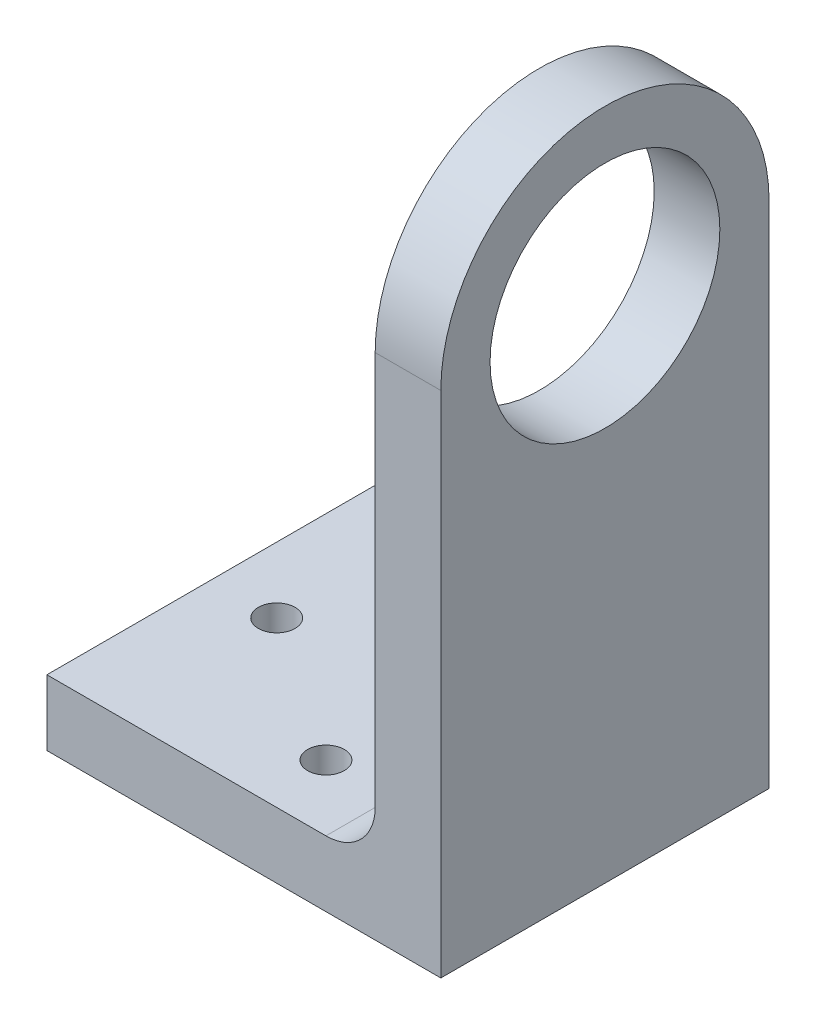
ISO-10303-21;
HEADER;
FILE_DESCRIPTION(('STEP AP214'),'2;1');
FILE_NAME('part.step','',(''),(''),'','','');
FILE_SCHEMA(('AUTOMOTIVE_DESIGN { 1 0 10303 214 1 1 1 1 }'));
ENDSEC;
DATA;
#1=APPLICATION_CONTEXT('core data for automotive mechanical design processes');
#2=APPLICATION_PROTOCOL_DEFINITION('international standard','automotive_design',2000,#1);
#3=PRODUCT_CONTEXT('',#1,'mechanical');
#4=PRODUCT('Part','Part','',(#3));
#5=PRODUCT_RELATED_PRODUCT_CATEGORY('part','',(#4));
#6=PRODUCT_DEFINITION_FORMATION('','',#4);
#7=PRODUCT_DEFINITION_CONTEXT('part definition',#1,'design');
#8=PRODUCT_DEFINITION('design','',#6,#7);
#9=PRODUCT_DEFINITION_SHAPE('','',#8);
#10=(LENGTH_UNIT() NAMED_UNIT(*) SI_UNIT(.MILLI.,.METRE.));
#11=(NAMED_UNIT(*) PLANE_ANGLE_UNIT() SI_UNIT($,.RADIAN.));
#12=(NAMED_UNIT(*) SI_UNIT($,.STERADIAN.) SOLID_ANGLE_UNIT());
#13=UNCERTAINTY_MEASURE_WITH_UNIT(LENGTH_MEASURE(1.E-05),#10,'distance_accuracy_value','');
#14=(GEOMETRIC_REPRESENTATION_CONTEXT(3) GLOBAL_UNCERTAINTY_ASSIGNED_CONTEXT((#13)) GLOBAL_UNIT_ASSIGNED_CONTEXT((#10,
#11,#12)) REPRESENTATION_CONTEXT('',''));
#15=CARTESIAN_POINT('',(0.,0.,0.));
#16=DIRECTION('',(0.,0.,1.));
#17=DIRECTION('',(1.,0.,0.));
#18=AXIS2_PLACEMENT_3D('',#15,#16,#17);
#19=CARTESIAN_POINT('',(6.35,42.8625,-15.875));
#20=DIRECTION('',(-1.,0.,0.));
#21=DIRECTION('',(0.,0.,1.));
#22=AXIS2_PLACEMENT_3D('',#19,#20,#21);
#23=PLANE('',#22);
#24=DIRECTION('',(0.,-1.,0.));
#25=VECTOR('',#24,1.);
#26=CARTESIAN_POINT('',(6.35,0.,0.));
#27=LINE('',#26,#25);
#28=CARTESIAN_POINT('',(6.35,42.8625,0.));
#29=VERTEX_POINT('',#28);
#30=CARTESIAN_POINT('',(6.35,-6.35,0.));
#31=VERTEX_POINT('',#30);
#32=EDGE_CURVE('E141',#29,#31,#27,.T.);
#33=ORIENTED_EDGE('',*,*,#32,.T.);
#34=DIRECTION('',(0.,0.,-1.));
#35=VECTOR('',#34,1.);
#36=CARTESIAN_POINT('',(6.35,-6.35,0.));
#37=LINE('',#36,#35);
#38=CARTESIAN_POINT('',(6.35,-6.34999999999999,-31.75));
#39=VERTEX_POINT('',#38);
#40=EDGE_CURVE('E101',#31,#39,#37,.T.);
#41=ORIENTED_EDGE('',*,*,#40,.T.);
#42=DIRECTION('',(0.,1.,0.));
#43=VECTOR('',#42,1.);
#44=CARTESIAN_POINT('',(6.35,0.,-31.75));
#45=LINE('',#44,#43);
#46=CARTESIAN_POINT('',(6.35,42.8625,-31.75));
#47=VERTEX_POINT('',#46);
#48=EDGE_CURVE('E143',#39,#47,#45,.T.);
#49=ORIENTED_EDGE('',*,*,#48,.T.);
#50=CARTESIAN_POINT('',(6.35,42.8625,-15.875));
#51=DIRECTION('',(1.,0.,0.));
#52=DIRECTION('',(0.,0.,1.));
#53=AXIS2_PLACEMENT_3D('',#50,#51,#52);
#54=CIRCLE('',#53,15.875);
#55=EDGE_CURVE('E146',#47,#29,#54,.T.);
#56=ORIENTED_EDGE('',*,*,#55,.T.);
#57=EDGE_LOOP('',(#33,#41,#49,#56));
#58=FACE_BOUND('',#57,.T.);
#59=CARTESIAN_POINT('',(6.35,42.8625,-15.875));
#60=DIRECTION('',(1.,0.,0.));
#61=DIRECTION('',(0.,0.,-1.));
#62=AXIS2_PLACEMENT_3D('',#59,#60,#61);
#63=CIRCLE('',#62,11.1125);
#64=CARTESIAN_POINT('',(6.35,42.8625,-26.9875));
#65=VERTEX_POINT('',#64);
#66=EDGE_CURVE('E135',#65,#65,#63,.T.);
#67=ORIENTED_EDGE('',*,*,#66,.F.);
#68=EDGE_LOOP('',(#67));
#69=FACE_BOUND('',#68,.T.);
#70=ADVANCED_FACE('F36',(#58,#69),#23,.F.);
#71=CARTESIAN_POINT('',(0.,42.8625,-15.875));
#72=DIRECTION('',(-1.,0.,0.));
#73=DIRECTION('',(0.,0.,1.));
#74=AXIS2_PLACEMENT_3D('',#71,#72,#73);
#75=PLANE('',#74);
#76=DIRECTION('',(0.,1.,0.));
#77=VECTOR('',#76,1.);
#78=CARTESIAN_POINT('',(0.,0.,-31.75));
#79=LINE('',#78,#77);
#80=CARTESIAN_POINT('',(0.,4.76250000000001,-31.75));
#81=VERTEX_POINT('',#80);
#82=CARTESIAN_POINT('',(0.,42.8625,-31.75));
#83=VERTEX_POINT('',#82);
#84=EDGE_CURVE('E150',#81,#83,#79,.T.);
#85=ORIENTED_EDGE('',*,*,#84,.F.);
#86=DIRECTION('',(0.,0.,-1.));
#87=VECTOR('',#86,1.);
#88=CARTESIAN_POINT('',(0.,4.7625,0.));
#89=LINE('',#88,#87);
#90=CARTESIAN_POINT('',(0.,4.7625,0.));
#91=VERTEX_POINT('',#90);
#92=EDGE_CURVE('E57',#81,#91,#89,.F.);
#93=ORIENTED_EDGE('',*,*,#92,.T.);
#94=DIRECTION('',(0.,-1.,0.));
#95=VECTOR('',#94,1.);
#96=CARTESIAN_POINT('',(0.,0.,0.));
#97=LINE('',#96,#95);
#98=CARTESIAN_POINT('',(0.,42.8625,0.));
#99=VERTEX_POINT('',#98);
#100=EDGE_CURVE('E138',#99,#91,#97,.T.);
#101=ORIENTED_EDGE('',*,*,#100,.F.);
#102=CARTESIAN_POINT('',(0.,42.8625,-15.875));
#103=DIRECTION('',(1.,0.,0.));
#104=DIRECTION('',(0.,0.,1.));
#105=AXIS2_PLACEMENT_3D('',#102,#103,#104);
#106=CIRCLE('',#105,15.875);
#107=EDGE_CURVE('E144',#83,#99,#106,.T.);
#108=ORIENTED_EDGE('',*,*,#107,.F.);
#109=EDGE_LOOP('',(#85,#93,#101,#108));
#110=FACE_BOUND('',#109,.T.);
#111=CARTESIAN_POINT('',(0.,42.8625,-15.875));
#112=DIRECTION('',(1.,0.,0.));
#113=DIRECTION('',(0.,0.,-1.));
#114=AXIS2_PLACEMENT_3D('',#111,#112,#113);
#115=CIRCLE('',#114,11.1125);
#116=CARTESIAN_POINT('',(0.,42.8625,-26.9875));
#117=VERTEX_POINT('',#116);
#118=EDGE_CURVE('E131',#117,#117,#115,.T.);
#119=ORIENTED_EDGE('',*,*,#118,.T.);
#120=EDGE_LOOP('',(#119));
#121=FACE_BOUND('',#120,.T.);
#122=ADVANCED_FACE('F174',(#110,#121),#75,.T.);
#123=CARTESIAN_POINT('',(6.35,0.,0.));
#124=DIRECTION('',(0.,0.,-1.));
#125=DIRECTION('',(-1.,0.,0.));
#126=AXIS2_PLACEMENT_3D('',#123,#124,#125);
#127=PLANE('',#126);
#128=ORIENTED_EDGE('',*,*,#100,.T.);
#129=CARTESIAN_POINT('',(-4.7625,4.7625,0.));
#130=DIRECTION('',(0.,0.,-1.));
#131=DIRECTION('',(-1.,0.,0.));
#132=AXIS2_PLACEMENT_3D('',#129,#130,#131);
#133=CIRCLE('',#132,4.7625);
#134=CARTESIAN_POINT('',(-4.76250000000001,0.,0.));
#135=VERTEX_POINT('',#134);
#136=EDGE_CURVE('E11',#91,#135,#133,.T.);
#137=ORIENTED_EDGE('',*,*,#136,.T.);
#138=DIRECTION('',(1.,0.,0.));
#139=VECTOR('',#138,1.);
#140=CARTESIAN_POINT('',(-31.75,0.,0.));
#141=LINE('',#140,#139);
#142=CARTESIAN_POINT('',(-31.75,0.,0.));
#143=VERTEX_POINT('',#142);
#144=EDGE_CURVE('E120',#143,#135,#141,.T.);
#145=ORIENTED_EDGE('',*,*,#144,.F.);
#146=DIRECTION('',(0.,-1.,0.));
#147=VECTOR('',#146,1.);
#148=CARTESIAN_POINT('',(-31.75,0.,0.));
#149=LINE('',#148,#147);
#150=CARTESIAN_POINT('',(-31.75,-6.35,0.));
#151=VERTEX_POINT('',#150);
#152=EDGE_CURVE('E113',#143,#151,#149,.T.);
#153=ORIENTED_EDGE('',*,*,#152,.T.);
#154=DIRECTION('',(1.,0.,0.));
#155=VECTOR('',#154,1.);
#156=CARTESIAN_POINT('',(-31.75,-6.35,0.));
#157=LINE('',#156,#155);
#158=EDGE_CURVE('E95',#151,#31,#157,.T.);
#159=ORIENTED_EDGE('',*,*,#158,.T.);
#160=ORIENTED_EDGE('',*,*,#32,.F.);
#161=DIRECTION('',(-1.,0.,0.));
#162=VECTOR('',#161,1.);
#163=CARTESIAN_POINT('',(6.35,42.8625,0.));
#164=LINE('',#163,#162);
#165=EDGE_CURVE('E148',#29,#99,#164,.T.);
#166=ORIENTED_EDGE('',*,*,#165,.T.);
#167=EDGE_LOOP('',(#128,#137,#145,#153,#159,#160,#166));
#168=FACE_BOUND('',#167,.T.);
#169=ADVANCED_FACE('F118',(#168),#127,.F.);
#170=CARTESIAN_POINT('',(6.35,0.,-31.75));
#171=DIRECTION('',(0.,0.,1.));
#172=DIRECTION('',(1.,0.,0.));
#173=AXIS2_PLACEMENT_3D('',#170,#171,#172);
#174=PLANE('',#173);
#175=DIRECTION('',(1.,0.,0.));
#176=VECTOR('',#175,1.);
#177=CARTESIAN_POINT('',(-31.75,0.,-31.75));
#178=LINE('',#177,#176);
#179=CARTESIAN_POINT('',(-31.75,0.,-31.75));
#180=VERTEX_POINT('',#179);
#181=CARTESIAN_POINT('',(-4.76250000000001,0.,-31.75));
#182=VERTEX_POINT('',#181);
#183=EDGE_CURVE('E132',#180,#182,#178,.T.);
#184=ORIENTED_EDGE('',*,*,#183,.T.);
#185=CARTESIAN_POINT('',(-4.7625,4.76250000000001,-31.75));
#186=DIRECTION('',(0.,0.,1.));
#187=DIRECTION('',(1.,0.,0.));
#188=AXIS2_PLACEMENT_3D('',#185,#186,#187);
#189=CIRCLE('',#188,4.7625);
#190=EDGE_CURVE('E44',#182,#81,#189,.T.);
#191=ORIENTED_EDGE('',*,*,#190,.T.);
#192=ORIENTED_EDGE('',*,*,#84,.T.);
#193=DIRECTION('',(-1.,0.,0.));
#194=VECTOR('',#193,1.);
#195=CARTESIAN_POINT('',(6.35,42.8625,-31.75));
#196=LINE('',#195,#194);
#197=EDGE_CURVE('E155',#47,#83,#196,.T.);
#198=ORIENTED_EDGE('',*,*,#197,.F.);
#199=ORIENTED_EDGE('',*,*,#48,.F.);
#200=DIRECTION('',(1.,0.,0.));
#201=VECTOR('',#200,1.);
#202=CARTESIAN_POINT('',(-31.75,-6.34999999999999,-31.75));
#203=LINE('',#202,#201);
#204=CARTESIAN_POINT('',(-31.75,-6.34999999999999,-31.75));
#205=VERTEX_POINT('',#204);
#206=EDGE_CURVE('E105',#205,#39,#203,.T.);
#207=ORIENTED_EDGE('',*,*,#206,.F.);
#208=DIRECTION('',(0.,1.,0.));
#209=VECTOR('',#208,1.);
#210=CARTESIAN_POINT('',(-31.75,0.,-31.75));
#211=LINE('',#210,#209);
#212=EDGE_CURVE('E116',#205,#180,#211,.T.);
#213=ORIENTED_EDGE('',*,*,#212,.T.);
#214=EDGE_LOOP('',(#184,#191,#192,#198,#199,#207,#213));
#215=FACE_BOUND('',#214,.T.);
#216=ADVANCED_FACE('F166',(#215),#174,.F.);
#217=CARTESIAN_POINT('',(6.35,42.8625,-15.875));
#218=DIRECTION('',(-1.,0.,0.));
#219=DIRECTION('',(0.,0.,1.));
#220=AXIS2_PLACEMENT_3D('',#217,#218,#219);
#221=CYLINDRICAL_SURFACE('',#220,15.875);
#222=ORIENTED_EDGE('',*,*,#107,.T.);
#223=ORIENTED_EDGE('',*,*,#165,.F.);
#224=ORIENTED_EDGE('',*,*,#55,.F.);
#225=ORIENTED_EDGE('',*,*,#197,.T.);
#226=EDGE_LOOP('',(#222,#223,#224,#225));
#227=FACE_BOUND('',#226,.T.);
#228=ADVANCED_FACE('F176',(#227),#221,.T.);
#229=CARTESIAN_POINT('',(6.35,42.8625,-15.875));
#230=DIRECTION('',(-1.,0.,0.));
#231=DIRECTION('',(0.,0.,1.));
#232=AXIS2_PLACEMENT_3D('',#229,#230,#231);
#233=CYLINDRICAL_SURFACE('',#232,11.1125);
#234=ORIENTED_EDGE('',*,*,#66,.T.);
#235=EDGE_LOOP('',(#234));
#236=FACE_BOUND('',#235,.T.);
#237=ORIENTED_EDGE('',*,*,#118,.F.);
#238=EDGE_LOOP('',(#237));
#239=FACE_BOUND('',#238,.T.);
#240=ADVANCED_FACE('F178',(#236,#239),#233,.F.);
#241=CARTESIAN_POINT('',(-31.75,0.,0.));
#242=DIRECTION('',(0.,1.,0.));
#243=DIRECTION('',(0.,0.,1.));
#244=AXIS2_PLACEMENT_3D('',#241,#242,#243);
#245=PLANE('',#244);
#246=CARTESIAN_POINT('',(-11.1125,0.,-6.35));
#247=DIRECTION('',(0.,1.,0.));
#248=DIRECTION('',(0.,0.,1.));
#249=AXIS2_PLACEMENT_3D('',#246,#247,#248);
#250=CIRCLE('',#249,1.777000002);
#251=CARTESIAN_POINT('',(-11.1125,0.,-4.572999998));
#252=VERTEX_POINT('',#251);
#253=EDGE_CURVE('E220',#252,#252,#250,.T.);
#254=ORIENTED_EDGE('',*,*,#253,.F.);
#255=EDGE_LOOP('',(#254));
#256=FACE_BOUND('',#255,.T.);
#257=CARTESIAN_POINT('',(-11.1125,0.,-25.4));
#258=DIRECTION('',(0.,1.,0.));
#259=DIRECTION('',(0.,0.,-1.));
#260=AXIS2_PLACEMENT_3D('',#257,#258,#259);
#261=CIRCLE('',#260,1.777000002);
#262=CARTESIAN_POINT('',(-11.1125,0.,-27.177000002));
#263=VERTEX_POINT('',#262);
#264=EDGE_CURVE('E221',#263,#263,#261,.T.);
#265=ORIENTED_EDGE('',*,*,#264,.F.);
#266=EDGE_LOOP('',(#265));
#267=FACE_BOUND('',#266,.T.);
#268=CARTESIAN_POINT('',(-25.4,0.,-15.875));
#269=DIRECTION('',(0.,1.,0.));
#270=DIRECTION('',(0.,0.,1.));
#271=AXIS2_PLACEMENT_3D('',#268,#269,#270);
#272=CIRCLE('',#271,1.777000002);
#273=CARTESIAN_POINT('',(-25.4,0.,-14.097999998));
#274=VERTEX_POINT('',#273);
#275=EDGE_CURVE('E229',#274,#274,#272,.T.);
#276=ORIENTED_EDGE('',*,*,#275,.F.);
#277=EDGE_LOOP('',(#276));
#278=FACE_BOUND('',#277,.T.);
#279=ORIENTED_EDGE('',*,*,#144,.T.);
#280=DIRECTION('',(0.,0.,-1.));
#281=VECTOR('',#280,1.);
#282=CARTESIAN_POINT('',(-4.7625,0.,-31.75));
#283=LINE('',#282,#281);
#284=EDGE_CURVE('E158',#135,#182,#283,.T.);
#285=ORIENTED_EDGE('',*,*,#284,.T.);
#286=ORIENTED_EDGE('',*,*,#183,.F.);
#287=DIRECTION('',(0.,0.,1.));
#288=VECTOR('',#287,1.);
#289=CARTESIAN_POINT('',(-31.75,0.,0.));
#290=LINE('',#289,#288);
#291=EDGE_CURVE('E106',#180,#143,#290,.T.);
#292=ORIENTED_EDGE('',*,*,#291,.T.);
#293=EDGE_LOOP('',(#279,#285,#286,#292));
#294=FACE_BOUND('',#293,.T.);
#295=ADVANCED_FACE('F163',(#256,#267,#278,#294),#245,.T.);
#296=CARTESIAN_POINT('',(-31.75,-6.35,0.));
#297=DIRECTION('',(0.,-1.,0.));
#298=DIRECTION('',(0.,0.,-1.));
#299=AXIS2_PLACEMENT_3D('',#296,#297,#298);
#300=PLANE('',#299);
#301=CARTESIAN_POINT('',(-11.1125,-6.35,-6.35));
#302=DIRECTION('',(0.,1.,0.));
#303=DIRECTION('',(0.,0.,1.));
#304=AXIS2_PLACEMENT_3D('',#301,#302,#303);
#305=CIRCLE('',#304,1.777000002);
#306=CARTESIAN_POINT('',(-11.1125,-6.35,-4.572999998));
#307=VERTEX_POINT('',#306);
#308=EDGE_CURVE('E122',#307,#307,#305,.T.);
#309=ORIENTED_EDGE('',*,*,#308,.T.);
#310=EDGE_LOOP('',(#309));
#311=FACE_BOUND('',#310,.T.);
#312=CARTESIAN_POINT('',(-11.1125,-6.35,-25.4));
#313=DIRECTION('',(0.,1.,0.));
#314=DIRECTION('',(0.,0.,-1.));
#315=AXIS2_PLACEMENT_3D('',#312,#313,#314);
#316=CIRCLE('',#315,1.777000002);
#317=CARTESIAN_POINT('',(-11.1125,-6.35,-27.177000002));
#318=VERTEX_POINT('',#317);
#319=EDGE_CURVE('E225',#318,#318,#316,.T.);
#320=ORIENTED_EDGE('',*,*,#319,.T.);
#321=EDGE_LOOP('',(#320));
#322=FACE_BOUND('',#321,.T.);
#323=CARTESIAN_POINT('',(-25.4,-6.35,-15.875));
#324=DIRECTION('',(0.,1.,0.));
#325=DIRECTION('',(0.,0.,1.));
#326=AXIS2_PLACEMENT_3D('',#323,#324,#325);
#327=CIRCLE('',#326,1.777000002);
#328=CARTESIAN_POINT('',(-25.4,-6.35,-14.097999998));
#329=VERTEX_POINT('',#328);
#330=EDGE_CURVE('E125',#329,#329,#327,.T.);
#331=ORIENTED_EDGE('',*,*,#330,.T.);
#332=EDGE_LOOP('',(#331));
#333=FACE_BOUND('',#332,.T.);
#334=ORIENTED_EDGE('',*,*,#40,.F.);
#335=ORIENTED_EDGE('',*,*,#158,.F.);
#336=DIRECTION('',(0.,0.,-1.));
#337=VECTOR('',#336,1.);
#338=CARTESIAN_POINT('',(-31.75,-6.35,0.));
#339=LINE('',#338,#337);
#340=EDGE_CURVE('E99',#151,#205,#339,.T.);
#341=ORIENTED_EDGE('',*,*,#340,.T.);
#342=ORIENTED_EDGE('',*,*,#206,.T.);
#343=EDGE_LOOP('',(#334,#335,#341,#342));
#344=FACE_BOUND('',#343,.T.);
#345=ADVANCED_FACE('F97',(#311,#322,#333,#344),#300,.T.);
#346=CARTESIAN_POINT('',(-31.75,0.,0.));
#347=DIRECTION('',(1.,0.,0.));
#348=DIRECTION('',(0.,0.,-1.));
#349=AXIS2_PLACEMENT_3D('',#346,#347,#348);
#350=PLANE('',#349);
#351=ORIENTED_EDGE('',*,*,#152,.F.);
#352=ORIENTED_EDGE('',*,*,#291,.F.);
#353=ORIENTED_EDGE('',*,*,#212,.F.);
#354=ORIENTED_EDGE('',*,*,#340,.F.);
#355=EDGE_LOOP('',(#351,#352,#353,#354));
#356=FACE_BOUND('',#355,.T.);
#357=ADVANCED_FACE('F111',(#356),#350,.F.);
#358=CARTESIAN_POINT('',(-4.7625,4.7625,0.));
#359=DIRECTION('',(0.,0.,1.));
#360=DIRECTION('',(0.,-1.,0.));
#361=AXIS2_PLACEMENT_3D('',#358,#359,#360);
#362=CYLINDRICAL_SURFACE('',#361,4.7625);
#363=ORIENTED_EDGE('',*,*,#136,.F.);
#364=ORIENTED_EDGE('',*,*,#92,.F.);
#365=ORIENTED_EDGE('',*,*,#190,.F.);
#366=ORIENTED_EDGE('',*,*,#284,.F.);
#367=EDGE_LOOP('',(#363,#364,#365,#366));
#368=FACE_BOUND('',#367,.T.);
#369=ADVANCED_FACE('F38',(#368),#362,.F.);
#370=CARTESIAN_POINT('',(-25.4,-6.35,-15.875));
#371=DIRECTION('',(0.,1.,0.));
#372=DIRECTION('',(0.,0.,1.));
#373=AXIS2_PLACEMENT_3D('',#370,#371,#372);
#374=CYLINDRICAL_SURFACE('',#373,1.777000002);
#375=ORIENTED_EDGE('',*,*,#330,.F.);
#376=EDGE_LOOP('',(#375));
#377=FACE_BOUND('',#376,.T.);
#378=ORIENTED_EDGE('',*,*,#275,.T.);
#379=EDGE_LOOP('',(#378));
#380=FACE_BOUND('',#379,.T.);
#381=ADVANCED_FACE('F202',(#377,#380),#374,.F.);
#382=CARTESIAN_POINT('',(-11.1125,-6.35,-25.4));
#383=DIRECTION('',(0.,1.,0.));
#384=DIRECTION('',(0.,0.,1.));
#385=AXIS2_PLACEMENT_3D('',#382,#383,#384);
#386=CYLINDRICAL_SURFACE('',#385,1.777000002);
#387=ORIENTED_EDGE('',*,*,#319,.F.);
#388=EDGE_LOOP('',(#387));
#389=FACE_BOUND('',#388,.T.);
#390=ORIENTED_EDGE('',*,*,#264,.T.);
#391=EDGE_LOOP('',(#390));
#392=FACE_BOUND('',#391,.T.);
#393=ADVANCED_FACE('F205',(#389,#392),#386,.F.);
#394=CARTESIAN_POINT('',(-11.1125,-6.35,-6.35));
#395=DIRECTION('',(0.,1.,0.));
#396=DIRECTION('',(0.,0.,1.));
#397=AXIS2_PLACEMENT_3D('',#394,#395,#396);
#398=CYLINDRICAL_SURFACE('',#397,1.777000002);
#399=ORIENTED_EDGE('',*,*,#308,.F.);
#400=EDGE_LOOP('',(#399));
#401=FACE_BOUND('',#400,.T.);
#402=ORIENTED_EDGE('',*,*,#253,.T.);
#403=EDGE_LOOP('',(#402));
#404=FACE_BOUND('',#403,.T.);
#405=ADVANCED_FACE('F209',(#401,#404),#398,.F.);
#406=CLOSED_SHELL('',(#70,#122,#169,#216,#228,#240,#295,#345,#357,#369,#381,#393,#405));
#407=MANIFOLD_SOLID_BREP('B2',#406);
#408=ADVANCED_BREP_SHAPE_REPRESENTATION('',(#18,#407),#14);
#409=SHAPE_DEFINITION_REPRESENTATION(#9,#408);
ENDSEC;
END-ISO-10303-21;
